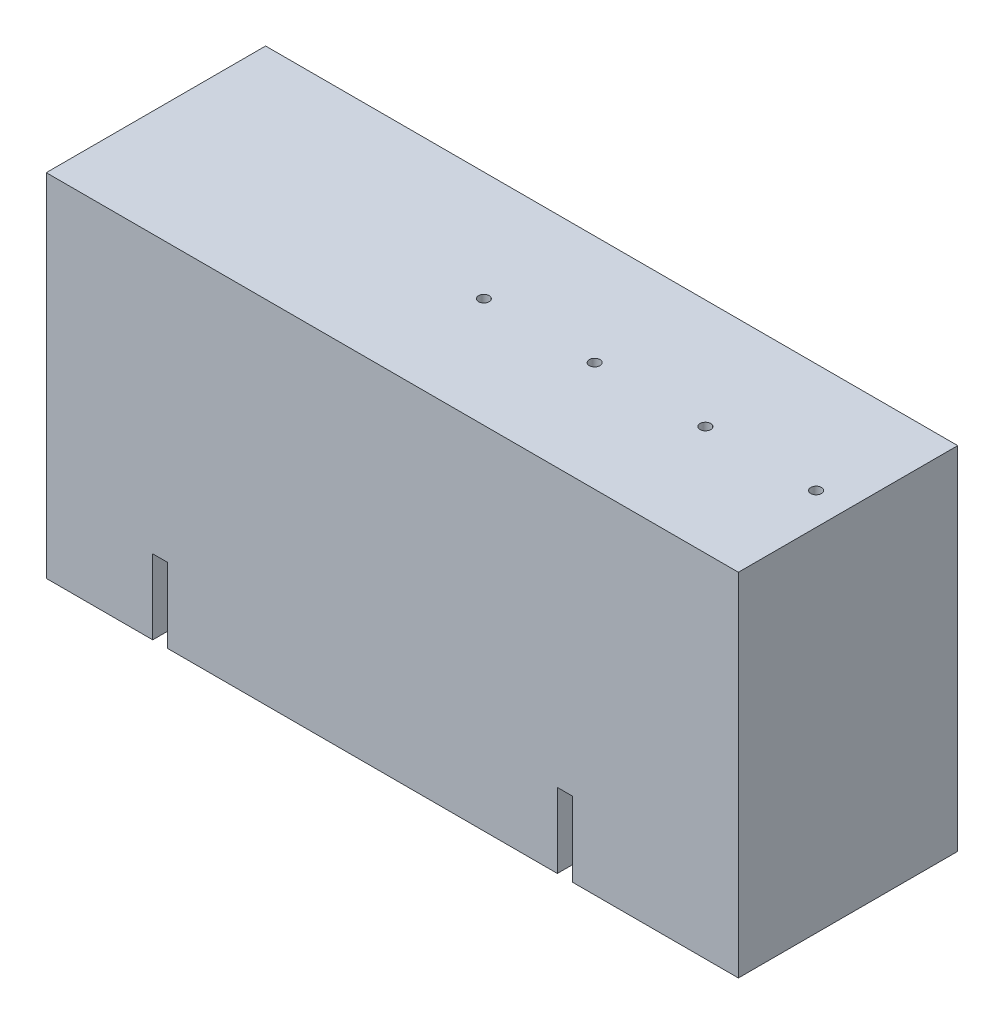
ISO-10303-21;
HEADER;
FILE_DESCRIPTION(('STEP AP214'),'2;1');
FILE_NAME('part.step','',(''),(''),'','','');
FILE_SCHEMA(('AUTOMOTIVE_DESIGN { 1 0 10303 214 1 1 1 1 }'));
ENDSEC;
DATA;
#1=APPLICATION_CONTEXT('core data for automotive mechanical design processes');
#2=APPLICATION_PROTOCOL_DEFINITION('international standard','automotive_design',2000,#1);
#3=PRODUCT_CONTEXT('',#1,'mechanical');
#4=PRODUCT('Part','Part','',(#3));
#5=PRODUCT_RELATED_PRODUCT_CATEGORY('part','',(#4));
#6=PRODUCT_DEFINITION_FORMATION('','',#4);
#7=PRODUCT_DEFINITION_CONTEXT('part definition',#1,'design');
#8=PRODUCT_DEFINITION('design','',#6,#7);
#9=PRODUCT_DEFINITION_SHAPE('','',#8);
#10=(LENGTH_UNIT() NAMED_UNIT(*) SI_UNIT(.MILLI.,.METRE.));
#11=(NAMED_UNIT(*) PLANE_ANGLE_UNIT() SI_UNIT($,.RADIAN.));
#12=(NAMED_UNIT(*) SI_UNIT($,.STERADIAN.) SOLID_ANGLE_UNIT());
#13=UNCERTAINTY_MEASURE_WITH_UNIT(LENGTH_MEASURE(1.E-05),#10,'distance_accuracy_value','');
#14=(GEOMETRIC_REPRESENTATION_CONTEXT(3) GLOBAL_UNCERTAINTY_ASSIGNED_CONTEXT((#13)) GLOBAL_UNIT_ASSIGNED_CONTEXT((#10,
#11,#12)) REPRESENTATION_CONTEXT('',''));
#15=CARTESIAN_POINT('',(0.,0.,0.));
#16=DIRECTION('',(0.,0.,1.));
#17=DIRECTION('',(1.,0.,0.));
#18=AXIS2_PLACEMENT_3D('',#15,#16,#17);
#19=CARTESIAN_POINT('',(0.,165.,0.));
#20=DIRECTION('',(1.,0.,0.));
#21=DIRECTION('',(0.,0.,-1.));
#22=AXIS2_PLACEMENT_3D('',#19,#20,#21);
#23=PLANE('',#22);
#24=DIRECTION('',(0.,0.,1.));
#25=VECTOR('',#24,1.);
#26=CARTESIAN_POINT('',(0.,0.,0.));
#27=LINE('',#26,#25);
#28=CARTESIAN_POINT('',(0.,0.,-103.));
#29=VERTEX_POINT('',#28);
#30=CARTESIAN_POINT('',(0.,0.,0.));
#31=VERTEX_POINT('',#30);
#32=EDGE_CURVE('E329',#29,#31,#27,.T.);
#33=ORIENTED_EDGE('',*,*,#32,.T.);
#34=DIRECTION('',(0.,-1.,0.));
#35=VECTOR('',#34,1.);
#36=CARTESIAN_POINT('',(0.,165.,0.));
#37=LINE('',#36,#35);
#38=CARTESIAN_POINT('',(0.,165.,0.));
#39=VERTEX_POINT('',#38);
#40=EDGE_CURVE('E11',#39,#31,#37,.T.);
#41=ORIENTED_EDGE('',*,*,#40,.F.);
#42=DIRECTION('',(0.,0.,1.));
#43=VECTOR('',#42,1.);
#44=CARTESIAN_POINT('',(0.,165.,0.));
#45=LINE('',#44,#43);
#46=CARTESIAN_POINT('',(0.,165.,-103.));
#47=VERTEX_POINT('',#46);
#48=EDGE_CURVE('E330',#47,#39,#45,.T.);
#49=ORIENTED_EDGE('',*,*,#48,.F.);
#50=DIRECTION('',(0.,-1.,0.));
#51=VECTOR('',#50,1.);
#52=CARTESIAN_POINT('',(0.,165.,-103.));
#53=LINE('',#52,#51);
#54=EDGE_CURVE('E340',#47,#29,#53,.T.);
#55=ORIENTED_EDGE('',*,*,#54,.T.);
#56=EDGE_LOOP('',(#33,#41,#49,#55));
#57=FACE_BOUND('',#56,.T.);
#58=ADVANCED_FACE('F42',(#57),#23,.F.);
#59=CARTESIAN_POINT('',(0.,165.,0.));
#60=DIRECTION('',(0.,0.,-1.));
#61=DIRECTION('',(-1.,0.,0.));
#62=AXIS2_PLACEMENT_3D('',#59,#60,#61);
#63=PLANE('',#62);
#64=DIRECTION('',(-1.,0.,0.));
#65=VECTOR('',#64,1.);
#66=CARTESIAN_POINT('',(247.,35.,0.));
#67=LINE('',#66,#65);
#68=CARTESIAN_POINT('',(247.,35.,0.));
#69=VERTEX_POINT('',#68);
#70=CARTESIAN_POINT('',(240.,35.,0.));
#71=VERTEX_POINT('',#70);
#72=EDGE_CURVE('E197',#69,#71,#67,.T.);
#73=ORIENTED_EDGE('',*,*,#72,.F.);
#74=DIRECTION('',(0.,-1.,0.));
#75=VECTOR('',#74,1.);
#76=CARTESIAN_POINT('',(247.,35.,0.));
#77=LINE('',#76,#75);
#78=CARTESIAN_POINT('',(247.,0.,0.));
#79=VERTEX_POINT('',#78);
#80=EDGE_CURVE('E294',#69,#79,#77,.T.);
#81=ORIENTED_EDGE('',*,*,#80,.T.);
#82=DIRECTION('',(1.,0.,0.));
#83=VECTOR('',#82,1.);
#84=CARTESIAN_POINT('',(0.,0.,0.));
#85=LINE('',#84,#83);
#86=CARTESIAN_POINT('',(325.,0.,0.));
#87=VERTEX_POINT('',#86);
#88=EDGE_CURVE('E343',#79,#87,#85,.T.);
#89=ORIENTED_EDGE('',*,*,#88,.T.);
#90=DIRECTION('',(0.,-1.,0.));
#91=VECTOR('',#90,1.);
#92=CARTESIAN_POINT('',(325.,165.,0.));
#93=LINE('',#92,#91);
#94=CARTESIAN_POINT('',(325.,165.,0.));
#95=VERTEX_POINT('',#94);
#96=EDGE_CURVE('E49',#95,#87,#93,.T.);
#97=ORIENTED_EDGE('',*,*,#96,.F.);
#98=DIRECTION('',(1.,0.,0.));
#99=VECTOR('',#98,1.);
#100=CARTESIAN_POINT('',(0.,165.,0.));
#101=LINE('',#100,#99);
#102=EDGE_CURVE('E333',#39,#95,#101,.T.);
#103=ORIENTED_EDGE('',*,*,#102,.F.);
#104=ORIENTED_EDGE('',*,*,#40,.T.);
#105=CARTESIAN_POINT('',(50.,0.,0.));
#106=VERTEX_POINT('',#105);
#107=EDGE_CURVE('E344',#31,#106,#85,.T.);
#108=ORIENTED_EDGE('',*,*,#107,.T.);
#109=DIRECTION('',(0.,-1.,0.));
#110=VECTOR('',#109,1.);
#111=CARTESIAN_POINT('',(50.,35.,0.));
#112=LINE('',#111,#110);
#113=CARTESIAN_POINT('',(50.,35.,0.));
#114=VERTEX_POINT('',#113);
#115=EDGE_CURVE('E289',#114,#106,#112,.T.);
#116=ORIENTED_EDGE('',*,*,#115,.F.);
#117=DIRECTION('',(-1.,0.,0.));
#118=VECTOR('',#117,1.);
#119=CARTESIAN_POINT('',(50.,35.,0.));
#120=LINE('',#119,#118);
#121=CARTESIAN_POINT('',(57.,35.,0.));
#122=VERTEX_POINT('',#121);
#123=EDGE_CURVE('E276',#122,#114,#120,.T.);
#124=ORIENTED_EDGE('',*,*,#123,.F.);
#125=DIRECTION('',(0.,-1.,0.));
#126=VECTOR('',#125,1.);
#127=CARTESIAN_POINT('',(57.,35.,0.));
#128=LINE('',#127,#126);
#129=CARTESIAN_POINT('',(57.,0.,0.));
#130=VERTEX_POINT('',#129);
#131=EDGE_CURVE('E298',#122,#130,#128,.T.);
#132=ORIENTED_EDGE('',*,*,#131,.T.);
#133=CARTESIAN_POINT('',(240.,0.,0.));
#134=VERTEX_POINT('',#133);
#135=EDGE_CURVE('E212',#130,#134,#85,.T.);
#136=ORIENTED_EDGE('',*,*,#135,.T.);
#137=DIRECTION('',(0.,-1.,0.));
#138=VECTOR('',#137,1.);
#139=CARTESIAN_POINT('',(240.,35.,0.));
#140=LINE('',#139,#138);
#141=EDGE_CURVE('E64',#71,#134,#140,.T.);
#142=ORIENTED_EDGE('',*,*,#141,.F.);
#143=EDGE_LOOP('',(#73,#81,#89,#97,#103,#104,#108,#116,#124,#132,#136,#142));
#144=FACE_BOUND('',#143,.T.);
#145=ADVANCED_FACE('F209',(#144),#63,.F.);
#146=CARTESIAN_POINT('',(325.,165.,0.));
#147=DIRECTION('',(-1.,0.,0.));
#148=DIRECTION('',(0.,0.,1.));
#149=AXIS2_PLACEMENT_3D('',#146,#147,#148);
#150=PLANE('',#149);
#151=DIRECTION('',(0.,0.,-1.));
#152=VECTOR('',#151,1.);
#153=CARTESIAN_POINT('',(325.,0.,0.));
#154=LINE('',#153,#152);
#155=CARTESIAN_POINT('',(325.,0.,-103.));
#156=VERTEX_POINT('',#155);
#157=EDGE_CURVE('E347',#87,#156,#154,.T.);
#158=ORIENTED_EDGE('',*,*,#157,.T.);
#159=DIRECTION('',(0.,-1.,0.));
#160=VECTOR('',#159,1.);
#161=CARTESIAN_POINT('',(325.,165.,-103.));
#162=LINE('',#161,#160);
#163=CARTESIAN_POINT('',(325.,165.,-103.));
#164=VERTEX_POINT('',#163);
#165=EDGE_CURVE('E355',#164,#156,#162,.T.);
#166=ORIENTED_EDGE('',*,*,#165,.F.);
#167=DIRECTION('',(0.,0.,-1.));
#168=VECTOR('',#167,1.);
#169=CARTESIAN_POINT('',(325.,165.,0.));
#170=LINE('',#169,#168);
#171=EDGE_CURVE('E336',#95,#164,#170,.T.);
#172=ORIENTED_EDGE('',*,*,#171,.F.);
#173=ORIENTED_EDGE('',*,*,#96,.T.);
#174=EDGE_LOOP('',(#158,#166,#172,#173));
#175=FACE_BOUND('',#174,.T.);
#176=ADVANCED_FACE('F362',(#175),#150,.F.);
#177=CARTESIAN_POINT('',(0.,165.,-103.));
#178=DIRECTION('',(0.,0.,1.));
#179=DIRECTION('',(1.,0.,0.));
#180=AXIS2_PLACEMENT_3D('',#177,#178,#179);
#181=PLANE('',#180);
#182=DIRECTION('',(1.,0.,0.));
#183=VECTOR('',#182,1.);
#184=CARTESIAN_POINT('',(50.,35.,-103.));
#185=LINE('',#184,#183);
#186=CARTESIAN_POINT('',(50.,35.,-103.));
#187=VERTEX_POINT('',#186);
#188=CARTESIAN_POINT('',(57.,35.,-103.));
#189=VERTEX_POINT('',#188);
#190=EDGE_CURVE('E248',#187,#189,#185,.T.);
#191=ORIENTED_EDGE('',*,*,#190,.F.);
#192=DIRECTION('',(0.,-1.,0.));
#193=VECTOR('',#192,1.);
#194=CARTESIAN_POINT('',(50.,35.,-103.));
#195=LINE('',#194,#193);
#196=CARTESIAN_POINT('',(50.,0.,-103.));
#197=VERTEX_POINT('',#196);
#198=EDGE_CURVE('E235',#187,#197,#195,.T.);
#199=ORIENTED_EDGE('',*,*,#198,.T.);
#200=DIRECTION('',(-1.,0.,0.));
#201=VECTOR('',#200,1.);
#202=CARTESIAN_POINT('',(0.,0.,-103.));
#203=LINE('',#202,#201);
#204=EDGE_CURVE('E349',#197,#29,#203,.T.);
#205=ORIENTED_EDGE('',*,*,#204,.T.);
#206=ORIENTED_EDGE('',*,*,#54,.F.);
#207=DIRECTION('',(-1.,0.,0.));
#208=VECTOR('',#207,1.);
#209=CARTESIAN_POINT('',(0.,165.,-103.));
#210=LINE('',#209,#208);
#211=EDGE_CURVE('E338',#164,#47,#210,.T.);
#212=ORIENTED_EDGE('',*,*,#211,.F.);
#213=ORIENTED_EDGE('',*,*,#165,.T.);
#214=CARTESIAN_POINT('',(247.,0.,-103.));
#215=VERTEX_POINT('',#214);
#216=EDGE_CURVE('E334',#156,#215,#203,.T.);
#217=ORIENTED_EDGE('',*,*,#216,.T.);
#218=DIRECTION('',(0.,-1.,0.));
#219=VECTOR('',#218,1.);
#220=CARTESIAN_POINT('',(247.,35.,-103.));
#221=LINE('',#220,#219);
#222=CARTESIAN_POINT('',(247.,35.,-103.));
#223=VERTEX_POINT('',#222);
#224=EDGE_CURVE('E239',#223,#215,#221,.T.);
#225=ORIENTED_EDGE('',*,*,#224,.F.);
#226=DIRECTION('',(1.,0.,0.));
#227=VECTOR('',#226,1.);
#228=CARTESIAN_POINT('',(247.,35.,-103.));
#229=LINE('',#228,#227);
#230=CARTESIAN_POINT('',(240.,35.,-103.));
#231=VERTEX_POINT('',#230);
#232=EDGE_CURVE('E229',#231,#223,#229,.T.);
#233=ORIENTED_EDGE('',*,*,#232,.F.);
#234=DIRECTION('',(0.,-1.,0.));
#235=VECTOR('',#234,1.);
#236=CARTESIAN_POINT('',(240.,35.,-103.));
#237=LINE('',#236,#235);
#238=CARTESIAN_POINT('',(240.,0.,-103.));
#239=VERTEX_POINT('',#238);
#240=EDGE_CURVE('E242',#231,#239,#237,.T.);
#241=ORIENTED_EDGE('',*,*,#240,.T.);
#242=CARTESIAN_POINT('',(57.,0.,-103.));
#243=VERTEX_POINT('',#242);
#244=EDGE_CURVE('E352',#239,#243,#203,.T.);
#245=ORIENTED_EDGE('',*,*,#244,.T.);
#246=DIRECTION('',(0.,-1.,0.));
#247=VECTOR('',#246,1.);
#248=CARTESIAN_POINT('',(57.,35.,-103.));
#249=LINE('',#248,#247);
#250=EDGE_CURVE('E261',#189,#243,#249,.T.);
#251=ORIENTED_EDGE('',*,*,#250,.F.);
#252=EDGE_LOOP('',(#191,#199,#205,#206,#212,#213,#217,#225,#233,#241,#245,#251));
#253=FACE_BOUND('',#252,.T.);
#254=ADVANCED_FACE('F374',(#253),#181,.F.);
#255=CARTESIAN_POINT('',(0.,165.,0.));
#256=DIRECTION('',(0.,-1.,0.));
#257=DIRECTION('',(0.,0.,-1.));
#258=AXIS2_PLACEMENT_3D('',#255,#256,#257);
#259=PLANE('',#258);
#260=CARTESIAN_POINT('',(310.,165.,-51.5));
#261=DIRECTION('',(0.,1.,0.));
#262=DIRECTION('',(0.,0.,1.));
#263=AXIS2_PLACEMENT_3D('',#260,#261,#262);
#264=CIRCLE('',#263,2.5);
#265=CARTESIAN_POINT('',(310.,165.,-49.));
#266=VERTEX_POINT('',#265);
#267=EDGE_CURVE('E300',#266,#266,#264,.T.);
#268=ORIENTED_EDGE('',*,*,#267,.F.);
#269=EDGE_LOOP('',(#268));
#270=FACE_BOUND('',#269,.T.);
#271=CARTESIAN_POINT('',(258.,165.,-51.5));
#272=DIRECTION('',(0.,1.,0.));
#273=DIRECTION('',(0.,0.,1.));
#274=AXIS2_PLACEMENT_3D('',#271,#272,#273);
#275=CIRCLE('',#274,2.5);
#276=CARTESIAN_POINT('',(258.,165.,-49.));
#277=VERTEX_POINT('',#276);
#278=EDGE_CURVE('E311',#277,#277,#275,.T.);
#279=ORIENTED_EDGE('',*,*,#278,.F.);
#280=EDGE_LOOP('',(#279));
#281=FACE_BOUND('',#280,.T.);
#282=CARTESIAN_POINT('',(206.,165.,-51.5));
#283=DIRECTION('',(0.,1.,0.));
#284=DIRECTION('',(0.,0.,1.));
#285=AXIS2_PLACEMENT_3D('',#282,#283,#284);
#286=CIRCLE('',#285,2.5);
#287=CARTESIAN_POINT('',(206.,165.,-49.));
#288=VERTEX_POINT('',#287);
#289=EDGE_CURVE('E317',#288,#288,#286,.T.);
#290=ORIENTED_EDGE('',*,*,#289,.F.);
#291=EDGE_LOOP('',(#290));
#292=FACE_BOUND('',#291,.T.);
#293=CARTESIAN_POINT('',(154.,165.,-51.5));
#294=DIRECTION('',(0.,1.,0.));
#295=DIRECTION('',(0.,0.,1.));
#296=AXIS2_PLACEMENT_3D('',#293,#294,#295);
#297=CIRCLE('',#296,2.5);
#298=CARTESIAN_POINT('',(154.,165.,-49.));
#299=VERTEX_POINT('',#298);
#300=EDGE_CURVE('E323',#299,#299,#297,.T.);
#301=ORIENTED_EDGE('',*,*,#300,.F.);
#302=EDGE_LOOP('',(#301));
#303=FACE_BOUND('',#302,.T.);
#304=ORIENTED_EDGE('',*,*,#48,.T.);
#305=ORIENTED_EDGE('',*,*,#102,.T.);
#306=ORIENTED_EDGE('',*,*,#171,.T.);
#307=ORIENTED_EDGE('',*,*,#211,.T.);
#308=EDGE_LOOP('',(#304,#305,#306,#307));
#309=FACE_BOUND('',#308,.T.);
#310=ADVANCED_FACE('F380',(#270,#281,#292,#303,#309),#259,.F.);
#311=CARTESIAN_POINT('',(0.,0.,0.));
#312=DIRECTION('',(0.,-1.,0.));
#313=DIRECTION('',(0.,0.,-1.));
#314=AXIS2_PLACEMENT_3D('',#311,#312,#313);
#315=PLANE('',#314);
#316=DIRECTION('',(0.,0.,-1.));
#317=VECTOR('',#316,1.);
#318=CARTESIAN_POINT('',(50.,0.,-103.));
#319=LINE('',#318,#317);
#320=CARTESIAN_POINT('',(50.,0.,-91.5000000000001));
#321=VERTEX_POINT('',#320);
#322=EDGE_CURVE('E252',#321,#197,#319,.T.);
#323=ORIENTED_EDGE('',*,*,#322,.F.);
#324=CARTESIAN_POINT('',(53.5,0.,-91.5));
#325=DIRECTION('',(0.,-1.,0.));
#326=DIRECTION('',(0.,0.,1.));
#327=AXIS2_PLACEMENT_3D('',#324,#325,#326);
#328=CIRCLE('',#327,3.49999999999998);
#329=CARTESIAN_POINT('',(57.,0.,-91.5000000000001));
#330=VERTEX_POINT('',#329);
#331=EDGE_CURVE('E265',#330,#321,#328,.T.);
#332=ORIENTED_EDGE('',*,*,#331,.F.);
#333=DIRECTION('',(0.,0.,1.));
#334=VECTOR('',#333,1.);
#335=CARTESIAN_POINT('',(57.,0.,-103.));
#336=LINE('',#335,#334);
#337=EDGE_CURVE('E262',#243,#330,#336,.T.);
#338=ORIENTED_EDGE('',*,*,#337,.F.);
#339=ORIENTED_EDGE('',*,*,#244,.F.);
#340=DIRECTION('',(0.,0.,-1.));
#341=VECTOR('',#340,1.);
#342=CARTESIAN_POINT('',(240.,0.,-103.));
#343=LINE('',#342,#341);
#344=CARTESIAN_POINT('',(240.,0.,-91.5));
#345=VERTEX_POINT('',#344);
#346=EDGE_CURVE('E223',#345,#239,#343,.T.);
#347=ORIENTED_EDGE('',*,*,#346,.F.);
#348=CARTESIAN_POINT('',(243.5,0.,-91.5));
#349=DIRECTION('',(0.,-1.,0.));
#350=DIRECTION('',(0.,0.,-1.));
#351=AXIS2_PLACEMENT_3D('',#348,#349,#350);
#352=CIRCLE('',#351,3.49999999999998);
#353=CARTESIAN_POINT('',(247.,0.,-91.5));
#354=VERTEX_POINT('',#353);
#355=EDGE_CURVE('E234',#354,#345,#352,.T.);
#356=ORIENTED_EDGE('',*,*,#355,.F.);
#357=DIRECTION('',(0.,0.,1.));
#358=VECTOR('',#357,1.);
#359=CARTESIAN_POINT('',(247.,0.,-103.));
#360=LINE('',#359,#358);
#361=EDGE_CURVE('E56',#215,#354,#360,.T.);
#362=ORIENTED_EDGE('',*,*,#361,.F.);
#363=ORIENTED_EDGE('',*,*,#216,.F.);
#364=ORIENTED_EDGE('',*,*,#157,.F.);
#365=ORIENTED_EDGE('',*,*,#88,.F.);
#366=DIRECTION('',(0.,0.,1.));
#367=VECTOR('',#366,1.);
#368=CARTESIAN_POINT('',(247.,0.,0.));
#369=LINE('',#368,#367);
#370=CARTESIAN_POINT('',(247.,0.,-11.5));
#371=VERTEX_POINT('',#370);
#372=EDGE_CURVE('E206',#371,#79,#369,.T.);
#373=ORIENTED_EDGE('',*,*,#372,.F.);
#374=CARTESIAN_POINT('',(243.5,0.,-11.5));
#375=DIRECTION('',(0.,-1.,0.));
#376=DIRECTION('',(0.,0.,1.));
#377=AXIS2_PLACEMENT_3D('',#374,#375,#376);
#378=CIRCLE('',#377,3.49999999999998);
#379=CARTESIAN_POINT('',(240.,0.,-11.5));
#380=VERTEX_POINT('',#379);
#381=EDGE_CURVE('E403',#380,#371,#378,.T.);
#382=ORIENTED_EDGE('',*,*,#381,.F.);
#383=DIRECTION('',(0.,0.,-1.));
#384=VECTOR('',#383,1.);
#385=CARTESIAN_POINT('',(240.,0.,0.));
#386=LINE('',#385,#384);
#387=EDGE_CURVE('E241',#134,#380,#386,.T.);
#388=ORIENTED_EDGE('',*,*,#387,.F.);
#389=ORIENTED_EDGE('',*,*,#135,.F.);
#390=DIRECTION('',(0.,0.,1.));
#391=VECTOR('',#390,1.);
#392=CARTESIAN_POINT('',(57.,0.,0.));
#393=LINE('',#392,#391);
#394=CARTESIAN_POINT('',(57.,0.,-11.5));
#395=VERTEX_POINT('',#394);
#396=EDGE_CURVE('E280',#395,#130,#393,.T.);
#397=ORIENTED_EDGE('',*,*,#396,.F.);
#398=CARTESIAN_POINT('',(53.5,0.,-11.5));
#399=DIRECTION('',(0.,-1.,0.));
#400=DIRECTION('',(0.,0.,-1.));
#401=AXIS2_PLACEMENT_3D('',#398,#399,#400);
#402=CIRCLE('',#401,3.5);
#403=CARTESIAN_POINT('',(50.,0.,-11.5));
#404=VERTEX_POINT('',#403);
#405=EDGE_CURVE('E293',#404,#395,#402,.T.);
#406=ORIENTED_EDGE('',*,*,#405,.F.);
#407=DIRECTION('',(0.,0.,-1.));
#408=VECTOR('',#407,1.);
#409=CARTESIAN_POINT('',(50.,0.,0.));
#410=LINE('',#409,#408);
#411=EDGE_CURVE('E290',#106,#404,#410,.T.);
#412=ORIENTED_EDGE('',*,*,#411,.F.);
#413=ORIENTED_EDGE('',*,*,#107,.F.);
#414=ORIENTED_EDGE('',*,*,#32,.F.);
#415=ORIENTED_EDGE('',*,*,#204,.F.);
#416=EDGE_LOOP('',(#323,#332,#338,#339,#347,#356,#362,#363,#364,#365,#373,#382,#388,#389,#397,
#406,#412,#413,#414,#415));
#417=FACE_BOUND('',#416,.T.);
#418=ADVANCED_FACE('F368',(#417),#315,.T.);
#419=CARTESIAN_POINT('',(154.,150.,-51.5));
#420=DIRECTION('',(0.,1.,0.));
#421=DIRECTION('',(0.,0.,1.));
#422=AXIS2_PLACEMENT_3D('',#419,#420,#421);
#423=CONICAL_SURFACE('',#422,2.5,1.02974425867665);
#424=CARTESIAN_POINT('',(154.,148.497848452431,-51.5));
#425=VERTEX_POINT('',#424);
#426=VERTEX_LOOP('',#425);
#427=FACE_BOUND('',#426,.T.);
#428=CARTESIAN_POINT('',(154.,150.,-51.5));
#429=DIRECTION('',(0.,1.,0.));
#430=DIRECTION('',(0.,0.,1.));
#431=AXIS2_PLACEMENT_3D('',#428,#429,#430);
#432=CIRCLE('',#431,2.5);
#433=CARTESIAN_POINT('',(154.,150.,-49.));
#434=VERTEX_POINT('',#433);
#435=EDGE_CURVE('E326',#434,#434,#432,.T.);
#436=ORIENTED_EDGE('',*,*,#435,.T.);
#437=EDGE_LOOP('',(#436));
#438=FACE_BOUND('',#437,.T.);
#439=ADVANCED_FACE('F431',(#427,#438),#423,.F.);
#440=CARTESIAN_POINT('',(154.,165.,-51.5));
#441=DIRECTION('',(0.,1.,0.));
#442=DIRECTION('',(0.,0.,1.));
#443=AXIS2_PLACEMENT_3D('',#440,#441,#442);
#444=CYLINDRICAL_SURFACE('',#443,2.5);
#445=ORIENTED_EDGE('',*,*,#435,.F.);
#446=EDGE_LOOP('',(#445));
#447=FACE_BOUND('',#446,.T.);
#448=ORIENTED_EDGE('',*,*,#300,.T.);
#449=EDGE_LOOP('',(#448));
#450=FACE_BOUND('',#449,.T.);
#451=ADVANCED_FACE('F437',(#447,#450),#444,.F.);
#452=CARTESIAN_POINT('',(206.,150.,-51.5));
#453=DIRECTION('',(0.,1.,0.));
#454=DIRECTION('',(0.,0.,1.));
#455=AXIS2_PLACEMENT_3D('',#452,#453,#454);
#456=CONICAL_SURFACE('',#455,2.5,1.02974425867665);
#457=CARTESIAN_POINT('',(206.,148.497848452431,-51.5));
#458=VERTEX_POINT('',#457);
#459=VERTEX_LOOP('',#458);
#460=FACE_BOUND('',#459,.T.);
#461=CARTESIAN_POINT('',(206.,150.,-51.5));
#462=DIRECTION('',(0.,1.,0.));
#463=DIRECTION('',(0.,0.,1.));
#464=AXIS2_PLACEMENT_3D('',#461,#462,#463);
#465=CIRCLE('',#464,2.5);
#466=CARTESIAN_POINT('',(206.,150.,-49.));
#467=VERTEX_POINT('',#466);
#468=EDGE_CURVE('E320',#467,#467,#465,.T.);
#469=ORIENTED_EDGE('',*,*,#468,.T.);
#470=EDGE_LOOP('',(#469));
#471=FACE_BOUND('',#470,.T.);
#472=ADVANCED_FACE('F441',(#460,#471),#456,.F.);
#473=CARTESIAN_POINT('',(206.,165.,-51.5));
#474=DIRECTION('',(0.,1.,0.));
#475=DIRECTION('',(0.,0.,1.));
#476=AXIS2_PLACEMENT_3D('',#473,#474,#475);
#477=CYLINDRICAL_SURFACE('',#476,2.5);
#478=ORIENTED_EDGE('',*,*,#468,.F.);
#479=EDGE_LOOP('',(#478));
#480=FACE_BOUND('',#479,.T.);
#481=ORIENTED_EDGE('',*,*,#289,.T.);
#482=EDGE_LOOP('',(#481));
#483=FACE_BOUND('',#482,.T.);
#484=ADVANCED_FACE('F445',(#480,#483),#477,.F.);
#485=CARTESIAN_POINT('',(258.,150.,-51.5));
#486=DIRECTION('',(0.,1.,0.));
#487=DIRECTION('',(0.,0.,1.));
#488=AXIS2_PLACEMENT_3D('',#485,#486,#487);
#489=CONICAL_SURFACE('',#488,2.5,1.02974425867665);
#490=CARTESIAN_POINT('',(258.,148.497848452431,-51.5));
#491=VERTEX_POINT('',#490);
#492=VERTEX_LOOP('',#491);
#493=FACE_BOUND('',#492,.T.);
#494=CARTESIAN_POINT('',(258.,150.,-51.5));
#495=DIRECTION('',(0.,1.,0.));
#496=DIRECTION('',(0.,0.,1.));
#497=AXIS2_PLACEMENT_3D('',#494,#495,#496);
#498=CIRCLE('',#497,2.5);
#499=CARTESIAN_POINT('',(258.,150.,-49.));
#500=VERTEX_POINT('',#499);
#501=EDGE_CURVE('E314',#500,#500,#498,.T.);
#502=ORIENTED_EDGE('',*,*,#501,.T.);
#503=EDGE_LOOP('',(#502));
#504=FACE_BOUND('',#503,.T.);
#505=ADVANCED_FACE('F449',(#493,#504),#489,.F.);
#506=CARTESIAN_POINT('',(258.,165.,-51.5));
#507=DIRECTION('',(0.,1.,0.));
#508=DIRECTION('',(0.,0.,1.));
#509=AXIS2_PLACEMENT_3D('',#506,#507,#508);
#510=CYLINDRICAL_SURFACE('',#509,2.5);
#511=ORIENTED_EDGE('',*,*,#501,.F.);
#512=EDGE_LOOP('',(#511));
#513=FACE_BOUND('',#512,.T.);
#514=ORIENTED_EDGE('',*,*,#278,.T.);
#515=EDGE_LOOP('',(#514));
#516=FACE_BOUND('',#515,.T.);
#517=ADVANCED_FACE('F453',(#513,#516),#510,.F.);
#518=CARTESIAN_POINT('',(310.,150.,-51.5));
#519=DIRECTION('',(0.,1.,0.));
#520=DIRECTION('',(0.,0.,1.));
#521=AXIS2_PLACEMENT_3D('',#518,#519,#520);
#522=CONICAL_SURFACE('',#521,2.5,1.02974425867665);
#523=CARTESIAN_POINT('',(310.,148.497848452431,-51.5));
#524=VERTEX_POINT('',#523);
#525=VERTEX_LOOP('',#524);
#526=FACE_BOUND('',#525,.T.);
#527=CARTESIAN_POINT('',(310.,150.,-51.5));
#528=DIRECTION('',(0.,1.,0.));
#529=DIRECTION('',(0.,0.,1.));
#530=AXIS2_PLACEMENT_3D('',#527,#528,#529);
#531=CIRCLE('',#530,2.5);
#532=CARTESIAN_POINT('',(310.,150.,-49.));
#533=VERTEX_POINT('',#532);
#534=EDGE_CURVE('E308',#533,#533,#531,.T.);
#535=ORIENTED_EDGE('',*,*,#534,.T.);
#536=EDGE_LOOP('',(#535));
#537=FACE_BOUND('',#536,.T.);
#538=ADVANCED_FACE('F457',(#526,#537),#522,.F.);
#539=CARTESIAN_POINT('',(310.,165.,-51.5));
#540=DIRECTION('',(0.,1.,0.));
#541=DIRECTION('',(0.,0.,1.));
#542=AXIS2_PLACEMENT_3D('',#539,#540,#541);
#543=CYLINDRICAL_SURFACE('',#542,2.5);
#544=ORIENTED_EDGE('',*,*,#534,.F.);
#545=EDGE_LOOP('',(#544));
#546=FACE_BOUND('',#545,.T.);
#547=ORIENTED_EDGE('',*,*,#267,.T.);
#548=EDGE_LOOP('',(#547));
#549=FACE_BOUND('',#548,.T.);
#550=ADVANCED_FACE('F461',(#546,#549),#543,.F.);
#551=CARTESIAN_POINT('',(57.,35.,0.));
#552=DIRECTION('',(1.,0.,0.));
#553=DIRECTION('',(0.,0.,-1.));
#554=AXIS2_PLACEMENT_3D('',#551,#552,#553);
#555=PLANE('',#554);
#556=ORIENTED_EDGE('',*,*,#396,.T.);
#557=ORIENTED_EDGE('',*,*,#131,.F.);
#558=DIRECTION('',(0.,0.,1.));
#559=VECTOR('',#558,1.);
#560=CARTESIAN_POINT('',(57.,35.,0.));
#561=LINE('',#560,#559);
#562=CARTESIAN_POINT('',(57.,35.,-11.5));
#563=VERTEX_POINT('',#562);
#564=EDGE_CURVE('E286',#563,#122,#561,.T.);
#565=ORIENTED_EDGE('',*,*,#564,.F.);
#566=DIRECTION('',(0.,-1.,0.));
#567=VECTOR('',#566,1.);
#568=CARTESIAN_POINT('',(57.,35.,-11.5));
#569=LINE('',#568,#567);
#570=EDGE_CURVE('E301',#563,#395,#569,.T.);
#571=ORIENTED_EDGE('',*,*,#570,.T.);
#572=EDGE_LOOP('',(#556,#557,#565,#571));
#573=FACE_BOUND('',#572,.T.);
#574=ADVANCED_FACE('F397',(#573),#555,.F.);
#575=CARTESIAN_POINT('',(53.5,35.,-11.5));
#576=DIRECTION('',(0.,-1.,0.));
#577=DIRECTION('',(0.,0.,-1.));
#578=AXIS2_PLACEMENT_3D('',#575,#576,#577);
#579=CYLINDRICAL_SURFACE('',#578,3.5);
#580=ORIENTED_EDGE('',*,*,#405,.T.);
#581=ORIENTED_EDGE('',*,*,#570,.F.);
#582=CARTESIAN_POINT('',(53.5,35.,-11.5));
#583=DIRECTION('',(0.,-1.,0.));
#584=DIRECTION('',(0.,0.,-1.));
#585=AXIS2_PLACEMENT_3D('',#582,#583,#584);
#586=CIRCLE('',#585,3.5);
#587=CARTESIAN_POINT('',(50.,35.,-11.5));
#588=VERTEX_POINT('',#587);
#589=EDGE_CURVE('E283',#588,#563,#586,.T.);
#590=ORIENTED_EDGE('',*,*,#589,.F.);
#591=DIRECTION('',(0.,-1.,0.));
#592=VECTOR('',#591,1.);
#593=CARTESIAN_POINT('',(50.,35.,-11.5));
#594=LINE('',#593,#592);
#595=EDGE_CURVE('E303',#588,#404,#594,.T.);
#596=ORIENTED_EDGE('',*,*,#595,.T.);
#597=EDGE_LOOP('',(#580,#581,#590,#596));
#598=FACE_BOUND('',#597,.T.);
#599=ADVANCED_FACE('F468',(#598),#579,.F.);
#600=CARTESIAN_POINT('',(50.,35.,0.));
#601=DIRECTION('',(-1.,0.,0.));
#602=DIRECTION('',(0.,0.,1.));
#603=AXIS2_PLACEMENT_3D('',#600,#601,#602);
#604=PLANE('',#603);
#605=ORIENTED_EDGE('',*,*,#411,.T.);
#606=ORIENTED_EDGE('',*,*,#595,.F.);
#607=DIRECTION('',(0.,0.,-1.));
#608=VECTOR('',#607,1.);
#609=CARTESIAN_POINT('',(50.,35.,0.));
#610=LINE('',#609,#608);
#611=EDGE_CURVE('E279',#114,#588,#610,.T.);
#612=ORIENTED_EDGE('',*,*,#611,.F.);
#613=ORIENTED_EDGE('',*,*,#115,.T.);
#614=EDGE_LOOP('',(#605,#606,#612,#613));
#615=FACE_BOUND('',#614,.T.);
#616=ADVANCED_FACE('F390',(#615),#604,.F.);
#617=CARTESIAN_POINT('',(53.5,35.,-11.5));
#618=DIRECTION('',(0.,-1.,0.));
#619=DIRECTION('',(0.,0.,-1.));
#620=AXIS2_PLACEMENT_3D('',#617,#618,#619);
#621=PLANE('',#620);
#622=ORIENTED_EDGE('',*,*,#123,.T.);
#623=ORIENTED_EDGE('',*,*,#611,.T.);
#624=ORIENTED_EDGE('',*,*,#589,.T.);
#625=ORIENTED_EDGE('',*,*,#564,.T.);
#626=EDGE_LOOP('',(#622,#623,#624,#625));
#627=FACE_BOUND('',#626,.T.);
#628=ADVANCED_FACE('F394',(#627),#621,.T.);
#629=CARTESIAN_POINT('',(247.,35.,0.));
#630=DIRECTION('',(1.,0.,0.));
#631=DIRECTION('',(0.,0.,-1.));
#632=AXIS2_PLACEMENT_3D('',#629,#630,#631);
#633=PLANE('',#632);
#634=ORIENTED_EDGE('',*,*,#372,.T.);
#635=ORIENTED_EDGE('',*,*,#80,.F.);
#636=DIRECTION('',(0.,0.,1.));
#637=VECTOR('',#636,1.);
#638=CARTESIAN_POINT('',(247.,35.,0.));
#639=LINE('',#638,#637);
#640=CARTESIAN_POINT('',(247.,35.,-11.5));
#641=VERTEX_POINT('',#640);
#642=EDGE_CURVE('E203',#641,#69,#639,.T.);
#643=ORIENTED_EDGE('',*,*,#642,.F.);
#644=DIRECTION('',(0.,-1.,0.));
#645=VECTOR('',#644,1.);
#646=CARTESIAN_POINT('',(247.,35.,-11.5));
#647=LINE('',#646,#645);
#648=EDGE_CURVE('E214',#641,#371,#647,.T.);
#649=ORIENTED_EDGE('',*,*,#648,.T.);
#650=EDGE_LOOP('',(#634,#635,#643,#649));
#651=FACE_BOUND('',#650,.T.);
#652=ADVANCED_FACE('F408',(#651),#633,.F.);
#653=CARTESIAN_POINT('',(243.5,35.,-11.5));
#654=DIRECTION('',(0.,-1.,0.));
#655=DIRECTION('',(0.,0.,-1.));
#656=AXIS2_PLACEMENT_3D('',#653,#654,#655);
#657=CYLINDRICAL_SURFACE('',#656,3.49999999999998);
#658=ORIENTED_EDGE('',*,*,#381,.T.);
#659=ORIENTED_EDGE('',*,*,#648,.F.);
#660=CARTESIAN_POINT('',(243.5,35.,-11.5));
#661=DIRECTION('',(0.,-1.,0.));
#662=DIRECTION('',(0.,0.,1.));
#663=AXIS2_PLACEMENT_3D('',#660,#661,#662);
#664=CIRCLE('',#663,3.49999999999998);
#665=CARTESIAN_POINT('',(240.,35.,-11.5));
#666=VERTEX_POINT('',#665);
#667=EDGE_CURVE('E196',#666,#641,#664,.T.);
#668=ORIENTED_EDGE('',*,*,#667,.F.);
#669=DIRECTION('',(0.,-1.,0.));
#670=VECTOR('',#669,1.);
#671=CARTESIAN_POINT('',(240.,35.,-11.5));
#672=LINE('',#671,#670);
#673=EDGE_CURVE('E192',#666,#380,#672,.T.);
#674=ORIENTED_EDGE('',*,*,#673,.T.);
#675=EDGE_LOOP('',(#658,#659,#668,#674));
#676=FACE_BOUND('',#675,.T.);
#677=ADVANCED_FACE('F409',(#676),#657,.F.);
#678=CARTESIAN_POINT('',(240.,35.,0.));
#679=DIRECTION('',(-1.,0.,0.));
#680=DIRECTION('',(0.,0.,1.));
#681=AXIS2_PLACEMENT_3D('',#678,#679,#680);
#682=PLANE('',#681);
#683=ORIENTED_EDGE('',*,*,#387,.T.);
#684=ORIENTED_EDGE('',*,*,#673,.F.);
#685=DIRECTION('',(0.,0.,-1.));
#686=VECTOR('',#685,1.);
#687=CARTESIAN_POINT('',(240.,35.,0.));
#688=LINE('',#687,#686);
#689=EDGE_CURVE('E189',#71,#666,#688,.T.);
#690=ORIENTED_EDGE('',*,*,#689,.F.);
#691=ORIENTED_EDGE('',*,*,#141,.T.);
#692=EDGE_LOOP('',(#683,#684,#690,#691));
#693=FACE_BOUND('',#692,.T.);
#694=ADVANCED_FACE('F191',(#693),#682,.F.);
#695=CARTESIAN_POINT('',(243.5,35.,-11.5));
#696=DIRECTION('',(0.,1.,0.));
#697=DIRECTION('',(0.,0.,1.));
#698=AXIS2_PLACEMENT_3D('',#695,#696,#697);
#699=PLANE('',#698);
#700=ORIENTED_EDGE('',*,*,#72,.T.);
#701=ORIENTED_EDGE('',*,*,#689,.T.);
#702=ORIENTED_EDGE('',*,*,#667,.T.);
#703=ORIENTED_EDGE('',*,*,#642,.T.);
#704=EDGE_LOOP('',(#700,#701,#702,#703));
#705=FACE_BOUND('',#704,.T.);
#706=ADVANCED_FACE('F201',(#705),#699,.F.);
#707=CARTESIAN_POINT('',(247.,35.,-103.));
#708=DIRECTION('',(1.,0.,0.));
#709=DIRECTION('',(0.,0.,-1.));
#710=AXIS2_PLACEMENT_3D('',#707,#708,#709);
#711=PLANE('',#710);
#712=ORIENTED_EDGE('',*,*,#361,.T.);
#713=DIRECTION('',(0.,-1.,0.));
#714=VECTOR('',#713,1.);
#715=CARTESIAN_POINT('',(247.,35.,-91.5));
#716=LINE('',#715,#714);
#717=CARTESIAN_POINT('',(247.,35.,-91.5));
#718=VERTEX_POINT('',#717);
#719=EDGE_CURVE('E232',#718,#354,#716,.T.);
#720=ORIENTED_EDGE('',*,*,#719,.F.);
#721=DIRECTION('',(0.,0.,1.));
#722=VECTOR('',#721,1.);
#723=CARTESIAN_POINT('',(247.,35.,-103.));
#724=LINE('',#723,#722);
#725=EDGE_CURVE('E219',#223,#718,#724,.T.);
#726=ORIENTED_EDGE('',*,*,#725,.F.);
#727=ORIENTED_EDGE('',*,*,#224,.T.);
#728=EDGE_LOOP('',(#712,#720,#726,#727));
#729=FACE_BOUND('',#728,.T.);
#730=ADVANCED_FACE('F493',(#729),#711,.F.);
#731=CARTESIAN_POINT('',(240.,35.,-103.));
#732=DIRECTION('',(-1.,0.,0.));
#733=DIRECTION('',(0.,0.,1.));
#734=AXIS2_PLACEMENT_3D('',#731,#732,#733);
#735=PLANE('',#734);
#736=ORIENTED_EDGE('',*,*,#346,.T.);
#737=ORIENTED_EDGE('',*,*,#240,.F.);
#738=DIRECTION('',(0.,0.,-1.));
#739=VECTOR('',#738,1.);
#740=CARTESIAN_POINT('',(240.,35.,-103.));
#741=LINE('',#740,#739);
#742=CARTESIAN_POINT('',(240.,35.,-91.5));
#743=VERTEX_POINT('',#742);
#744=EDGE_CURVE('E226',#743,#231,#741,.T.);
#745=ORIENTED_EDGE('',*,*,#744,.F.);
#746=DIRECTION('',(0.,-1.,0.));
#747=VECTOR('',#746,1.);
#748=CARTESIAN_POINT('',(240.,35.,-91.5));
#749=LINE('',#748,#747);
#750=EDGE_CURVE('E245',#743,#345,#749,.T.);
#751=ORIENTED_EDGE('',*,*,#750,.T.);
#752=EDGE_LOOP('',(#736,#737,#745,#751));
#753=FACE_BOUND('',#752,.T.);
#754=ADVANCED_FACE('F496',(#753),#735,.F.);
#755=CARTESIAN_POINT('',(243.5,35.,-91.5));
#756=DIRECTION('',(0.,-1.,0.));
#757=DIRECTION('',(0.,0.,-1.));
#758=AXIS2_PLACEMENT_3D('',#755,#756,#757);
#759=CYLINDRICAL_SURFACE('',#758,3.49999999999998);
#760=ORIENTED_EDGE('',*,*,#355,.T.);
#761=ORIENTED_EDGE('',*,*,#750,.F.);
#762=CARTESIAN_POINT('',(243.5,35.,-91.5));
#763=DIRECTION('',(0.,-1.,0.));
#764=DIRECTION('',(0.,0.,-1.));
#765=AXIS2_PLACEMENT_3D('',#762,#763,#764);
#766=CIRCLE('',#765,3.49999999999998);
#767=EDGE_CURVE('E222',#718,#743,#766,.T.);
#768=ORIENTED_EDGE('',*,*,#767,.F.);
#769=ORIENTED_EDGE('',*,*,#719,.T.);
#770=EDGE_LOOP('',(#760,#761,#768,#769));
#771=FACE_BOUND('',#770,.T.);
#772=ADVANCED_FACE('F497',(#771),#759,.F.);
#773=CARTESIAN_POINT('',(243.5,35.,-91.5));
#774=DIRECTION('',(0.,-1.,0.));
#775=DIRECTION('',(0.,0.,-1.));
#776=AXIS2_PLACEMENT_3D('',#773,#774,#775);
#777=PLANE('',#776);
#778=ORIENTED_EDGE('',*,*,#725,.T.);
#779=ORIENTED_EDGE('',*,*,#767,.T.);
#780=ORIENTED_EDGE('',*,*,#744,.T.);
#781=ORIENTED_EDGE('',*,*,#232,.T.);
#782=EDGE_LOOP('',(#778,#779,#780,#781));
#783=FACE_BOUND('',#782,.T.);
#784=ADVANCED_FACE('F488',(#783),#777,.T.);
#785=CARTESIAN_POINT('',(50.,35.,-103.));
#786=DIRECTION('',(-1.,0.,0.));
#787=DIRECTION('',(0.,0.,1.));
#788=AXIS2_PLACEMENT_3D('',#785,#786,#787);
#789=PLANE('',#788);
#790=ORIENTED_EDGE('',*,*,#322,.T.);
#791=ORIENTED_EDGE('',*,*,#198,.F.);
#792=DIRECTION('',(0.,0.,-1.));
#793=VECTOR('',#792,1.);
#794=CARTESIAN_POINT('',(50.,35.,-103.));
#795=LINE('',#794,#793);
#796=CARTESIAN_POINT('',(50.,35.,-91.5000000000001));
#797=VERTEX_POINT('',#796);
#798=EDGE_CURVE('E258',#797,#187,#795,.T.);
#799=ORIENTED_EDGE('',*,*,#798,.F.);
#800=DIRECTION('',(0.,-1.,0.));
#801=VECTOR('',#800,1.);
#802=CARTESIAN_POINT('',(50.,35.,-91.5000000000001));
#803=LINE('',#802,#801);
#804=EDGE_CURVE('E271',#797,#321,#803,.T.);
#805=ORIENTED_EDGE('',*,*,#804,.T.);
#806=EDGE_LOOP('',(#790,#791,#799,#805));
#807=FACE_BOUND('',#806,.T.);
#808=ADVANCED_FACE('F484',(#807),#789,.F.);
#809=CARTESIAN_POINT('',(53.5,35.,-91.5));
#810=DIRECTION('',(0.,-1.,0.));
#811=DIRECTION('',(0.,0.,-1.));
#812=AXIS2_PLACEMENT_3D('',#809,#810,#811);
#813=CYLINDRICAL_SURFACE('',#812,3.49999999999998);
#814=ORIENTED_EDGE('',*,*,#331,.T.);
#815=ORIENTED_EDGE('',*,*,#804,.F.);
#816=CARTESIAN_POINT('',(53.5,35.,-91.5));
#817=DIRECTION('',(0.,-1.,0.));
#818=DIRECTION('',(0.,0.,1.));
#819=AXIS2_PLACEMENT_3D('',#816,#817,#818);
#820=CIRCLE('',#819,3.49999999999998);
#821=CARTESIAN_POINT('',(57.,35.,-91.5000000000001));
#822=VERTEX_POINT('',#821);
#823=EDGE_CURVE('E255',#822,#797,#820,.T.);
#824=ORIENTED_EDGE('',*,*,#823,.F.);
#825=DIRECTION('',(0.,-1.,0.));
#826=VECTOR('',#825,1.);
#827=CARTESIAN_POINT('',(57.,35.,-91.5000000000001));
#828=LINE('',#827,#826);
#829=EDGE_CURVE('E273',#822,#330,#828,.T.);
#830=ORIENTED_EDGE('',*,*,#829,.T.);
#831=EDGE_LOOP('',(#814,#815,#824,#830));
#832=FACE_BOUND('',#831,.T.);
#833=ADVANCED_FACE('F480',(#832),#813,.F.);
#834=CARTESIAN_POINT('',(57.,35.,-103.));
#835=DIRECTION('',(1.,0.,0.));
#836=DIRECTION('',(0.,0.,-1.));
#837=AXIS2_PLACEMENT_3D('',#834,#835,#836);
#838=PLANE('',#837);
#839=ORIENTED_EDGE('',*,*,#337,.T.);
#840=ORIENTED_EDGE('',*,*,#829,.F.);
#841=DIRECTION('',(0.,0.,1.));
#842=VECTOR('',#841,1.);
#843=CARTESIAN_POINT('',(57.,35.,-103.));
#844=LINE('',#843,#842);
#845=EDGE_CURVE('E251',#189,#822,#844,.T.);
#846=ORIENTED_EDGE('',*,*,#845,.F.);
#847=ORIENTED_EDGE('',*,*,#250,.T.);
#848=EDGE_LOOP('',(#839,#840,#846,#847));
#849=FACE_BOUND('',#848,.T.);
#850=ADVANCED_FACE('F476',(#849),#838,.F.);
#851=CARTESIAN_POINT('',(53.5,35.,-91.5));
#852=DIRECTION('',(0.,1.,0.));
#853=DIRECTION('',(0.,0.,1.));
#854=AXIS2_PLACEMENT_3D('',#851,#852,#853);
#855=PLANE('',#854);
#856=ORIENTED_EDGE('',*,*,#190,.T.);
#857=ORIENTED_EDGE('',*,*,#845,.T.);
#858=ORIENTED_EDGE('',*,*,#823,.T.);
#859=ORIENTED_EDGE('',*,*,#798,.T.);
#860=EDGE_LOOP('',(#856,#857,#858,#859));
#861=FACE_BOUND('',#860,.T.);
#862=ADVANCED_FACE('F479',(#861),#855,.F.);
#863=CLOSED_SHELL('',(#58,#145,#176,#254,#310,#418,#439,#451,#472,#484,#505,#517,#538,#550,#574,
#599,#616,#628,#652,#677,#694,#706,#730,#754,#772,#784,#808,#833,#850,#862));
#864=MANIFOLD_SOLID_BREP('B2',#863);
#865=ADVANCED_BREP_SHAPE_REPRESENTATION('',(#18,#864),#14);
#866=SHAPE_DEFINITION_REPRESENTATION(#9,#865);
ENDSEC;
END-ISO-10303-21;
